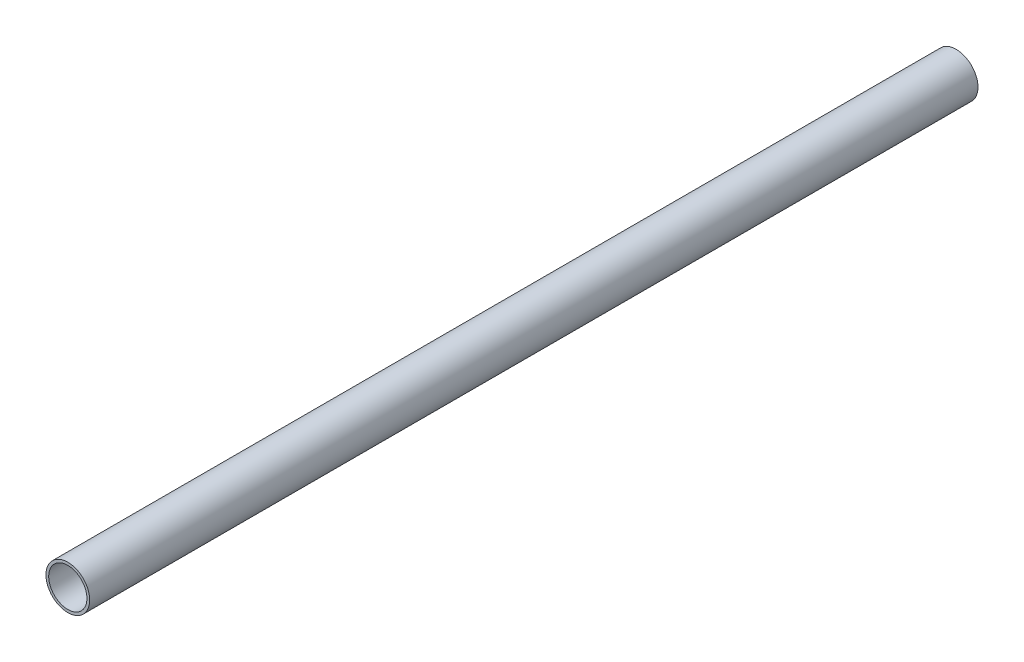
ISO-10303-21;
HEADER;
FILE_DESCRIPTION(('STEP AP214'),'2;1');
FILE_NAME('part.step','',(''),(''),'','','');
FILE_SCHEMA(('AUTOMOTIVE_DESIGN { 1 0 10303 214 1 1 1 1 }'));
ENDSEC;
DATA;
#1=APPLICATION_CONTEXT('core data for automotive mechanical design processes');
#2=APPLICATION_PROTOCOL_DEFINITION('international standard','automotive_design',2000,#1);
#3=PRODUCT_CONTEXT('',#1,'mechanical');
#4=PRODUCT('Part','Part','',(#3));
#5=PRODUCT_RELATED_PRODUCT_CATEGORY('part','',(#4));
#6=PRODUCT_DEFINITION_FORMATION('','',#4);
#7=PRODUCT_DEFINITION_CONTEXT('part definition',#1,'design');
#8=PRODUCT_DEFINITION('design','',#6,#7);
#9=PRODUCT_DEFINITION_SHAPE('','',#8);
#10=(LENGTH_UNIT() NAMED_UNIT(*) SI_UNIT(.MILLI.,.METRE.));
#11=(NAMED_UNIT(*) PLANE_ANGLE_UNIT() SI_UNIT($,.RADIAN.));
#12=(NAMED_UNIT(*) SI_UNIT($,.STERADIAN.) SOLID_ANGLE_UNIT());
#13=UNCERTAINTY_MEASURE_WITH_UNIT(LENGTH_MEASURE(1.E-05),#10,'distance_accuracy_value','');
#14=(GEOMETRIC_REPRESENTATION_CONTEXT(3) GLOBAL_UNCERTAINTY_ASSIGNED_CONTEXT((#13)) GLOBAL_UNIT_ASSIGNED_CONTEXT((#10,
#11,#12)) REPRESENTATION_CONTEXT('',''));
#15=CARTESIAN_POINT('',(0.,0.,0.));
#16=DIRECTION('',(0.,0.,1.));
#17=DIRECTION('',(1.,0.,0.));
#18=AXIS2_PLACEMENT_3D('',#15,#16,#17);
#19=CARTESIAN_POINT('',(0.,0.,325.28));
#20=DIRECTION('',(0.,0.,1.));
#21=DIRECTION('',(1.,0.,0.));
#22=AXIS2_PLACEMENT_3D('',#19,#20,#21);
#23=PLANE('',#22);
#24=CARTESIAN_POINT('',(0.,0.,325.28));
#25=DIRECTION('',(0.,0.,1.));
#26=DIRECTION('',(1.,0.,0.));
#27=AXIS2_PLACEMENT_3D('',#24,#25,#26);
#28=CIRCLE('',#27,8.);
#29=CARTESIAN_POINT('',(8.,0.,325.28));
#30=VERTEX_POINT('',#29);
#31=EDGE_CURVE('E10',#30,#30,#28,.T.);
#32=ORIENTED_EDGE('',*,*,#31,.T.);
#33=EDGE_LOOP('',(#32));
#34=FACE_BOUND('',#33,.T.);
#35=CARTESIAN_POINT('',(0.,0.,325.28));
#36=DIRECTION('',(0.,0.,1.));
#37=DIRECTION('',(1.,0.,0.));
#38=AXIS2_PLACEMENT_3D('',#35,#36,#37);
#39=CIRCLE('',#38,7.);
#40=CARTESIAN_POINT('',(7.,0.,325.28));
#41=VERTEX_POINT('',#40);
#42=EDGE_CURVE('E54',#41,#41,#39,.T.);
#43=ORIENTED_EDGE('',*,*,#42,.F.);
#44=EDGE_LOOP('',(#43));
#45=FACE_BOUND('',#44,.T.);
#46=ADVANCED_FACE('F41',(#34,#45),#23,.T.);
#47=CARTESIAN_POINT('',(0.,0.,0.));
#48=DIRECTION('',(0.,0.,1.));
#49=DIRECTION('',(1.,0.,0.));
#50=AXIS2_PLACEMENT_3D('',#47,#48,#49);
#51=PLANE('',#50);
#52=CARTESIAN_POINT('',(0.,0.,0.));
#53=DIRECTION('',(0.,0.,1.));
#54=DIRECTION('',(1.,0.,0.));
#55=AXIS2_PLACEMENT_3D('',#52,#53,#54);
#56=CIRCLE('',#55,8.);
#57=CARTESIAN_POINT('',(8.,0.,0.));
#58=VERTEX_POINT('',#57);
#59=EDGE_CURVE('E45',#58,#58,#56,.T.);
#60=ORIENTED_EDGE('',*,*,#59,.F.);
#61=EDGE_LOOP('',(#60));
#62=FACE_BOUND('',#61,.T.);
#63=CARTESIAN_POINT('',(0.,0.,0.));
#64=DIRECTION('',(0.,0.,1.));
#65=DIRECTION('',(1.,0.,0.));
#66=AXIS2_PLACEMENT_3D('',#63,#64,#65);
#67=CIRCLE('',#66,7.);
#68=CARTESIAN_POINT('',(7.,0.,0.));
#69=VERTEX_POINT('',#68);
#70=EDGE_CURVE('E56',#69,#69,#67,.T.);
#71=ORIENTED_EDGE('',*,*,#70,.T.);
#72=EDGE_LOOP('',(#71));
#73=FACE_BOUND('',#72,.T.);
#74=ADVANCED_FACE('F68',(#62,#73),#51,.F.);
#75=CARTESIAN_POINT('',(0.,0.,325.28));
#76=DIRECTION('',(0.,0.,-1.));
#77=DIRECTION('',(-1.,0.,0.));
#78=AXIS2_PLACEMENT_3D('',#75,#76,#77);
#79=CYLINDRICAL_SURFACE('',#78,8.);
#80=ORIENTED_EDGE('',*,*,#31,.F.);
#81=EDGE_LOOP('',(#80));
#82=FACE_BOUND('',#81,.T.);
#83=ORIENTED_EDGE('',*,*,#59,.T.);
#84=EDGE_LOOP('',(#83));
#85=FACE_BOUND('',#84,.T.);
#86=ADVANCED_FACE('F43',(#82,#85),#79,.T.);
#87=CARTESIAN_POINT('',(0.,0.,325.28));
#88=DIRECTION('',(0.,0.,-1.));
#89=DIRECTION('',(-1.,0.,0.));
#90=AXIS2_PLACEMENT_3D('',#87,#88,#89);
#91=CYLINDRICAL_SURFACE('',#90,7.);
#92=ORIENTED_EDGE('',*,*,#42,.T.);
#93=EDGE_LOOP('',(#92));
#94=FACE_BOUND('',#93,.T.);
#95=ORIENTED_EDGE('',*,*,#70,.F.);
#96=EDGE_LOOP('',(#95));
#97=FACE_BOUND('',#96,.T.);
#98=ADVANCED_FACE('F64',(#94,#97),#91,.F.);
#99=CLOSED_SHELL('',(#46,#74,#86,#98));
#100=MANIFOLD_SOLID_BREP('B2',#99);
#101=ADVANCED_BREP_SHAPE_REPRESENTATION('',(#18,#100),#14);
#102=SHAPE_DEFINITION_REPRESENTATION(#9,#101);
ENDSEC;
END-ISO-10303-21;
